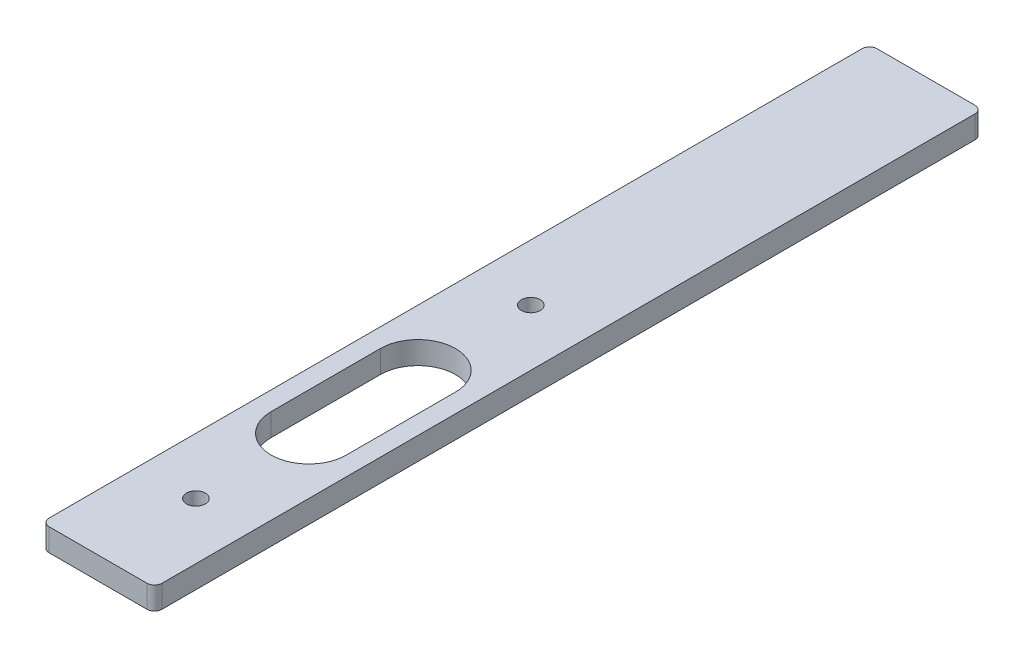
ISO-10303-21;
HEADER;
FILE_DESCRIPTION(('STEP AP214'),'2;1');
FILE_NAME('part.step','',(''),(''),'','','');
FILE_SCHEMA(('AUTOMOTIVE_DESIGN { 1 0 10303 214 1 1 1 1 }'));
ENDSEC;
DATA;
#1=APPLICATION_CONTEXT('core data for automotive mechanical design processes');
#2=APPLICATION_PROTOCOL_DEFINITION('international standard','automotive_design',2000,#1);
#3=PRODUCT_CONTEXT('',#1,'mechanical');
#4=PRODUCT('Part','Part','',(#3));
#5=PRODUCT_RELATED_PRODUCT_CATEGORY('part','',(#4));
#6=PRODUCT_DEFINITION_FORMATION('','',#4);
#7=PRODUCT_DEFINITION_CONTEXT('part definition',#1,'design');
#8=PRODUCT_DEFINITION('design','',#6,#7);
#9=PRODUCT_DEFINITION_SHAPE('','',#8);
#10=(LENGTH_UNIT() NAMED_UNIT(*) SI_UNIT(.MILLI.,.METRE.));
#11=(NAMED_UNIT(*) PLANE_ANGLE_UNIT() SI_UNIT($,.RADIAN.));
#12=(NAMED_UNIT(*) SI_UNIT($,.STERADIAN.) SOLID_ANGLE_UNIT());
#13=UNCERTAINTY_MEASURE_WITH_UNIT(LENGTH_MEASURE(1.E-05),#10,'distance_accuracy_value','');
#14=(GEOMETRIC_REPRESENTATION_CONTEXT(3) GLOBAL_UNCERTAINTY_ASSIGNED_CONTEXT((#13)) GLOBAL_UNIT_ASSIGNED_CONTEXT((#10,
#11,#12)) REPRESENTATION_CONTEXT('',''));
#15=CARTESIAN_POINT('',(0.,0.,0.));
#16=DIRECTION('',(0.,0.,1.));
#17=DIRECTION('',(1.,0.,0.));
#18=AXIS2_PLACEMENT_3D('',#15,#16,#17);
#19=CARTESIAN_POINT('',(0.,3.,0.));
#20=DIRECTION('',(1.,0.,0.));
#21=DIRECTION('',(0.,0.,-1.));
#22=AXIS2_PLACEMENT_3D('',#19,#20,#21);
#23=PLANE('',#22);
#24=DIRECTION('',(0.,0.,1.));
#25=VECTOR('',#24,1.);
#26=CARTESIAN_POINT('',(0.,3.,0.));
#27=LINE('',#26,#25);
#28=CARTESIAN_POINT('',(0.,3.,-109.));
#29=VERTEX_POINT('',#28);
#30=CARTESIAN_POINT('',(0.,3.,-1.));
#31=VERTEX_POINT('',#30);
#32=EDGE_CURVE('E163',#29,#31,#27,.T.);
#33=ORIENTED_EDGE('',*,*,#32,.F.);
#34=DIRECTION('',(0.,-1.,0.));
#35=VECTOR('',#34,1.);
#36=CARTESIAN_POINT('',(0.,3.,-109.));
#37=LINE('',#36,#35);
#38=CARTESIAN_POINT('',(0.,0.,-109.));
#39=VERTEX_POINT('',#38);
#40=EDGE_CURVE('E214',#29,#39,#37,.T.);
#41=ORIENTED_EDGE('',*,*,#40,.T.);
#42=DIRECTION('',(0.,0.,1.));
#43=VECTOR('',#42,1.);
#44=CARTESIAN_POINT('',(0.,0.,0.));
#45=LINE('',#44,#43);
#46=CARTESIAN_POINT('',(0.,0.,-1.));
#47=VERTEX_POINT('',#46);
#48=EDGE_CURVE('E154',#39,#47,#45,.T.);
#49=ORIENTED_EDGE('',*,*,#48,.T.);
#50=DIRECTION('',(0.,-1.,0.));
#51=VECTOR('',#50,1.);
#52=CARTESIAN_POINT('',(0.,3.,-1.));
#53=LINE('',#52,#51);
#54=EDGE_CURVE('E212',#47,#31,#53,.F.);
#55=ORIENTED_EDGE('',*,*,#54,.T.);
#56=EDGE_LOOP('',(#33,#41,#49,#55));
#57=FACE_BOUND('',#56,.T.);
#58=ADVANCED_FACE('F34',(#57),#23,.F.);
#59=CARTESIAN_POINT('',(0.,3.,0.));
#60=DIRECTION('',(0.,0.,-1.));
#61=DIRECTION('',(-1.,0.,0.));
#62=AXIS2_PLACEMENT_3D('',#59,#60,#61);
#63=PLANE('',#62);
#64=DIRECTION('',(1.,0.,0.));
#65=VECTOR('',#64,1.);
#66=CARTESIAN_POINT('',(0.,0.,0.));
#67=LINE('',#66,#65);
#68=CARTESIAN_POINT('',(1.,0.,0.));
#69=VERTEX_POINT('',#68);
#70=CARTESIAN_POINT('',(14.,0.,0.));
#71=VERTEX_POINT('',#70);
#72=EDGE_CURVE('E179',#69,#71,#67,.T.);
#73=ORIENTED_EDGE('',*,*,#72,.T.);
#74=DIRECTION('',(0.,-1.,0.));
#75=VECTOR('',#74,1.);
#76=CARTESIAN_POINT('',(14.,3.,0.));
#77=LINE('',#76,#75);
#78=CARTESIAN_POINT('',(14.,3.,0.));
#79=VERTEX_POINT('',#78);
#80=EDGE_CURVE('E220',#71,#79,#77,.F.);
#81=ORIENTED_EDGE('',*,*,#80,.T.);
#82=DIRECTION('',(1.,0.,0.));
#83=VECTOR('',#82,1.);
#84=CARTESIAN_POINT('',(0.,3.,0.));
#85=LINE('',#84,#83);
#86=CARTESIAN_POINT('',(1.,3.,0.));
#87=VERTEX_POINT('',#86);
#88=EDGE_CURVE('E166',#87,#79,#85,.T.);
#89=ORIENTED_EDGE('',*,*,#88,.F.);
#90=DIRECTION('',(0.,-1.,0.));
#91=VECTOR('',#90,1.);
#92=CARTESIAN_POINT('',(1.,3.,0.));
#93=LINE('',#92,#91);
#94=EDGE_CURVE('E217',#87,#69,#93,.T.);
#95=ORIENTED_EDGE('',*,*,#94,.T.);
#96=EDGE_LOOP('',(#73,#81,#89,#95));
#97=FACE_BOUND('',#96,.T.);
#98=ADVANCED_FACE('F246',(#97),#63,.F.);
#99=CARTESIAN_POINT('',(15.,3.,0.));
#100=DIRECTION('',(-1.,0.,0.));
#101=DIRECTION('',(0.,0.,1.));
#102=AXIS2_PLACEMENT_3D('',#99,#100,#101);
#103=PLANE('',#102);
#104=DIRECTION('',(0.,0.,-1.));
#105=VECTOR('',#104,1.);
#106=CARTESIAN_POINT('',(15.,0.,0.));
#107=LINE('',#106,#105);
#108=CARTESIAN_POINT('',(15.,0.,-1.));
#109=VERTEX_POINT('',#108);
#110=CARTESIAN_POINT('',(15.,0.,-109.));
#111=VERTEX_POINT('',#110);
#112=EDGE_CURVE('E182',#109,#111,#107,.T.);
#113=ORIENTED_EDGE('',*,*,#112,.T.);
#114=DIRECTION('',(0.,-1.,0.));
#115=VECTOR('',#114,1.);
#116=CARTESIAN_POINT('',(15.,3.,-109.));
#117=LINE('',#116,#115);
#118=CARTESIAN_POINT('',(15.,3.,-109.));
#119=VERTEX_POINT('',#118);
#120=EDGE_CURVE('E202',#111,#119,#117,.F.);
#121=ORIENTED_EDGE('',*,*,#120,.T.);
#122=DIRECTION('',(0.,0.,-1.));
#123=VECTOR('',#122,1.);
#124=CARTESIAN_POINT('',(15.,3.,0.));
#125=LINE('',#124,#123);
#126=CARTESIAN_POINT('',(15.,3.,-1.));
#127=VERTEX_POINT('',#126);
#128=EDGE_CURVE('E170',#127,#119,#125,.T.);
#129=ORIENTED_EDGE('',*,*,#128,.F.);
#130=DIRECTION('',(0.,-1.,0.));
#131=VECTOR('',#130,1.);
#132=CARTESIAN_POINT('',(15.,3.,-1.));
#133=LINE('',#132,#131);
#134=EDGE_CURVE('E199',#127,#109,#133,.T.);
#135=ORIENTED_EDGE('',*,*,#134,.T.);
#136=EDGE_LOOP('',(#113,#121,#129,#135));
#137=FACE_BOUND('',#136,.T.);
#138=ADVANCED_FACE('F252',(#137),#103,.F.);
#139=CARTESIAN_POINT('',(0.,3.,-110.));
#140=DIRECTION('',(0.,0.,1.));
#141=DIRECTION('',(1.,0.,0.));
#142=AXIS2_PLACEMENT_3D('',#139,#140,#141);
#143=PLANE('',#142);
#144=DIRECTION('',(-1.,0.,0.));
#145=VECTOR('',#144,1.);
#146=CARTESIAN_POINT('',(0.,3.,-110.));
#147=LINE('',#146,#145);
#148=CARTESIAN_POINT('',(14.,3.,-110.));
#149=VERTEX_POINT('',#148);
#150=CARTESIAN_POINT('',(1.,3.,-110.));
#151=VERTEX_POINT('',#150);
#152=EDGE_CURVE('E173',#149,#151,#147,.T.);
#153=ORIENTED_EDGE('',*,*,#152,.F.);
#154=DIRECTION('',(0.,-1.,0.));
#155=VECTOR('',#154,1.);
#156=CARTESIAN_POINT('',(14.,3.,-110.));
#157=LINE('',#156,#155);
#158=CARTESIAN_POINT('',(14.,0.,-110.));
#159=VERTEX_POINT('',#158);
#160=EDGE_CURVE('E188',#149,#159,#157,.T.);
#161=ORIENTED_EDGE('',*,*,#160,.T.);
#162=DIRECTION('',(-1.,0.,0.));
#163=VECTOR('',#162,1.);
#164=CARTESIAN_POINT('',(0.,0.,-110.));
#165=LINE('',#164,#163);
#166=CARTESIAN_POINT('',(1.,0.,-110.));
#167=VERTEX_POINT('',#166);
#168=EDGE_CURVE('E167',#159,#167,#165,.T.);
#169=ORIENTED_EDGE('',*,*,#168,.T.);
#170=DIRECTION('',(0.,-1.,0.));
#171=VECTOR('',#170,1.);
#172=CARTESIAN_POINT('',(1.,3.,-110.));
#173=LINE('',#172,#171);
#174=EDGE_CURVE('E176',#167,#151,#173,.F.);
#175=ORIENTED_EDGE('',*,*,#174,.T.);
#176=EDGE_LOOP('',(#153,#161,#169,#175));
#177=FACE_BOUND('',#176,.T.);
#178=ADVANCED_FACE('F286',(#177),#143,.F.);
#179=CARTESIAN_POINT('',(0.,3.,0.));
#180=DIRECTION('',(0.,-1.,0.));
#181=DIRECTION('',(0.,0.,-1.));
#182=AXIS2_PLACEMENT_3D('',#179,#180,#181);
#183=PLANE('',#182);
#184=DIRECTION('',(0.,0.,1.));
#185=VECTOR('',#184,1.);
#186=CARTESIAN_POINT('',(2.5,3.,-42.5));
#187=LINE('',#186,#185);
#188=CARTESIAN_POINT('',(2.5,3.,-42.5));
#189=VERTEX_POINT('',#188);
#190=CARTESIAN_POINT('',(2.50000000000001,3.,-28.));
#191=VERTEX_POINT('',#190);
#192=EDGE_CURVE('E134',#189,#191,#187,.T.);
#193=ORIENTED_EDGE('',*,*,#192,.F.);
#194=CARTESIAN_POINT('',(7.5,3.,-42.5));
#195=DIRECTION('',(0.,1.,0.));
#196=DIRECTION('',(0.,0.,1.));
#197=AXIS2_PLACEMENT_3D('',#194,#195,#196);
#198=CIRCLE('',#197,5.);
#199=CARTESIAN_POINT('',(12.5,3.,-42.5));
#200=VERTEX_POINT('',#199);
#201=EDGE_CURVE('E49',#200,#189,#198,.T.);
#202=ORIENTED_EDGE('',*,*,#201,.F.);
#203=DIRECTION('',(0.,0.,-1.));
#204=VECTOR('',#203,1.);
#205=CARTESIAN_POINT('',(12.5,3.,-42.5));
#206=LINE('',#205,#204);
#207=CARTESIAN_POINT('',(12.5,3.,-28.));
#208=VERTEX_POINT('',#207);
#209=EDGE_CURVE('E141',#208,#200,#206,.T.);
#210=ORIENTED_EDGE('',*,*,#209,.F.);
#211=CARTESIAN_POINT('',(7.5,3.,-28.));
#212=DIRECTION('',(0.,1.,0.));
#213=DIRECTION('',(0.,0.,1.));
#214=AXIS2_PLACEMENT_3D('',#211,#212,#213);
#215=CIRCLE('',#214,5.);
#216=EDGE_CURVE('E125',#191,#208,#215,.T.);
#217=ORIENTED_EDGE('',*,*,#216,.F.);
#218=EDGE_LOOP('',(#193,#202,#210,#217));
#219=FACE_BOUND('',#218,.T.);
#220=CARTESIAN_POINT('',(7.5,3.,-13.));
#221=DIRECTION('',(0.,1.,0.));
#222=DIRECTION('',(0.,0.,1.));
#223=AXIS2_PLACEMENT_3D('',#220,#221,#222);
#224=CIRCLE('',#223,1.25);
#225=CARTESIAN_POINT('',(7.5,3.,-11.75));
#226=VERTEX_POINT('',#225);
#227=EDGE_CURVE('E155',#226,#226,#224,.T.);
#228=ORIENTED_EDGE('',*,*,#227,.F.);
#229=EDGE_LOOP('',(#228));
#230=FACE_BOUND('',#229,.T.);
#231=CARTESIAN_POINT('',(7.5,3.,-57.5));
#232=DIRECTION('',(0.,1.,0.));
#233=DIRECTION('',(0.,0.,1.));
#234=AXIS2_PLACEMENT_3D('',#231,#232,#233);
#235=CIRCLE('',#234,1.25);
#236=CARTESIAN_POINT('',(7.5,3.,-56.25));
#237=VERTEX_POINT('',#236);
#238=EDGE_CURVE('E148',#237,#237,#235,.T.);
#239=ORIENTED_EDGE('',*,*,#238,.F.);
#240=EDGE_LOOP('',(#239));
#241=FACE_BOUND('',#240,.T.);
#242=ORIENTED_EDGE('',*,*,#128,.T.);
#243=CARTESIAN_POINT('',(14.,3.,-109.));
#244=DIRECTION('',(0.,-1.,0.));
#245=DIRECTION('',(0.,0.,-1.));
#246=AXIS2_PLACEMENT_3D('',#243,#244,#245);
#247=CIRCLE('',#246,1.);
#248=EDGE_CURVE('E210',#119,#149,#247,.F.);
#249=ORIENTED_EDGE('',*,*,#248,.T.);
#250=ORIENTED_EDGE('',*,*,#152,.T.);
#251=CARTESIAN_POINT('',(1.,3.,-109.));
#252=DIRECTION('',(0.,-1.,0.));
#253=DIRECTION('',(0.,0.,-1.));
#254=AXIS2_PLACEMENT_3D('',#251,#252,#253);
#255=CIRCLE('',#254,1.);
#256=EDGE_CURVE('E208',#151,#29,#255,.F.);
#257=ORIENTED_EDGE('',*,*,#256,.T.);
#258=ORIENTED_EDGE('',*,*,#32,.T.);
#259=CARTESIAN_POINT('',(1.,3.,-1.));
#260=DIRECTION('',(0.,-1.,0.));
#261=DIRECTION('',(0.,0.,-1.));
#262=AXIS2_PLACEMENT_3D('',#259,#260,#261);
#263=CIRCLE('',#262,1.);
#264=EDGE_CURVE('E204',#31,#87,#263,.F.);
#265=ORIENTED_EDGE('',*,*,#264,.T.);
#266=ORIENTED_EDGE('',*,*,#88,.T.);
#267=CARTESIAN_POINT('',(14.,3.,-1.));
#268=DIRECTION('',(0.,-1.,0.));
#269=DIRECTION('',(0.,0.,-1.));
#270=AXIS2_PLACEMENT_3D('',#267,#268,#269);
#271=CIRCLE('',#270,1.);
#272=EDGE_CURVE('E206',#79,#127,#271,.F.);
#273=ORIENTED_EDGE('',*,*,#272,.T.);
#274=EDGE_LOOP('',(#242,#249,#250,#257,#258,#265,#266,#273));
#275=FACE_BOUND('',#274,.T.);
#276=ADVANCED_FACE('F138',(#219,#230,#241,#275),#183,.F.);
#277=CARTESIAN_POINT('',(0.,0.,0.));
#278=DIRECTION('',(0.,-1.,0.));
#279=DIRECTION('',(0.,0.,-1.));
#280=AXIS2_PLACEMENT_3D('',#277,#278,#279);
#281=PLANE('',#280);
#282=CARTESIAN_POINT('',(7.5,0.,-42.5));
#283=DIRECTION('',(0.,-1.,0.));
#284=DIRECTION('',(0.,0.,-1.));
#285=AXIS2_PLACEMENT_3D('',#282,#283,#284);
#286=CIRCLE('',#285,5.);
#287=CARTESIAN_POINT('',(2.5,0.,-42.5));
#288=VERTEX_POINT('',#287);
#289=CARTESIAN_POINT('',(12.5,0.,-42.5));
#290=VERTEX_POINT('',#289);
#291=EDGE_CURVE('E11',#288,#290,#286,.T.);
#292=ORIENTED_EDGE('',*,*,#291,.F.);
#293=DIRECTION('',(0.,0.,-1.));
#294=VECTOR('',#293,1.);
#295=CARTESIAN_POINT('',(2.50000000000001,0.,0.));
#296=LINE('',#295,#294);
#297=CARTESIAN_POINT('',(2.50000000000001,0.,-28.));
#298=VERTEX_POINT('',#297);
#299=EDGE_CURVE('E222',#298,#288,#296,.T.);
#300=ORIENTED_EDGE('',*,*,#299,.F.);
#301=CARTESIAN_POINT('',(7.5,0.,-28.));
#302=DIRECTION('',(0.,-1.,0.));
#303=DIRECTION('',(0.,0.,-1.));
#304=AXIS2_PLACEMENT_3D('',#301,#302,#303);
#305=CIRCLE('',#304,5.);
#306=CARTESIAN_POINT('',(12.5,0.,-28.));
#307=VERTEX_POINT('',#306);
#308=EDGE_CURVE('E128',#307,#298,#305,.T.);
#309=ORIENTED_EDGE('',*,*,#308,.F.);
#310=DIRECTION('',(0.,0.,1.));
#311=VECTOR('',#310,1.);
#312=CARTESIAN_POINT('',(12.5,0.,0.));
#313=LINE('',#312,#311);
#314=EDGE_CURVE('E42',#290,#307,#313,.T.);
#315=ORIENTED_EDGE('',*,*,#314,.F.);
#316=EDGE_LOOP('',(#292,#300,#309,#315));
#317=FACE_BOUND('',#316,.T.);
#318=CARTESIAN_POINT('',(7.5,0.,-13.));
#319=DIRECTION('',(0.,1.,0.));
#320=DIRECTION('',(0.,0.,1.));
#321=AXIS2_PLACEMENT_3D('',#318,#319,#320);
#322=CIRCLE('',#321,1.25);
#323=CARTESIAN_POINT('',(7.5,0.,-11.75));
#324=VERTEX_POINT('',#323);
#325=EDGE_CURVE('E151',#324,#324,#322,.T.);
#326=ORIENTED_EDGE('',*,*,#325,.T.);
#327=EDGE_LOOP('',(#326));
#328=FACE_BOUND('',#327,.T.);
#329=CARTESIAN_POINT('',(7.5,0.,-57.5));
#330=DIRECTION('',(0.,1.,0.));
#331=DIRECTION('',(0.,0.,1.));
#332=AXIS2_PLACEMENT_3D('',#329,#330,#331);
#333=CIRCLE('',#332,1.25);
#334=CARTESIAN_POINT('',(7.5,0.,-56.25));
#335=VERTEX_POINT('',#334);
#336=EDGE_CURVE('E158',#335,#335,#333,.T.);
#337=ORIENTED_EDGE('',*,*,#336,.T.);
#338=EDGE_LOOP('',(#337));
#339=FACE_BOUND('',#338,.T.);
#340=ORIENTED_EDGE('',*,*,#168,.F.);
#341=CARTESIAN_POINT('',(14.,0.,-109.));
#342=DIRECTION('',(0.,-1.,0.));
#343=DIRECTION('',(0.,0.,-1.));
#344=AXIS2_PLACEMENT_3D('',#341,#342,#343);
#345=CIRCLE('',#344,1.);
#346=EDGE_CURVE('E197',#159,#111,#345,.T.);
#347=ORIENTED_EDGE('',*,*,#346,.T.);
#348=ORIENTED_EDGE('',*,*,#112,.F.);
#349=CARTESIAN_POINT('',(14.,0.,-1.));
#350=DIRECTION('',(0.,-1.,0.));
#351=DIRECTION('',(0.,0.,-1.));
#352=AXIS2_PLACEMENT_3D('',#349,#350,#351);
#353=CIRCLE('',#352,1.);
#354=EDGE_CURVE('E193',#109,#71,#353,.T.);
#355=ORIENTED_EDGE('',*,*,#354,.T.);
#356=ORIENTED_EDGE('',*,*,#72,.F.);
#357=CARTESIAN_POINT('',(1.,0.,-1.));
#358=DIRECTION('',(0.,-1.,0.));
#359=DIRECTION('',(0.,0.,-1.));
#360=AXIS2_PLACEMENT_3D('',#357,#358,#359);
#361=CIRCLE('',#360,1.);
#362=EDGE_CURVE('E191',#69,#47,#361,.T.);
#363=ORIENTED_EDGE('',*,*,#362,.T.);
#364=ORIENTED_EDGE('',*,*,#48,.F.);
#365=CARTESIAN_POINT('',(1.,0.,-109.));
#366=DIRECTION('',(0.,-1.,0.));
#367=DIRECTION('',(0.,0.,-1.));
#368=AXIS2_PLACEMENT_3D('',#365,#366,#367);
#369=CIRCLE('',#368,1.);
#370=EDGE_CURVE('E195',#39,#167,#369,.T.);
#371=ORIENTED_EDGE('',*,*,#370,.T.);
#372=EDGE_LOOP('',(#340,#347,#348,#355,#356,#363,#364,#371));
#373=FACE_BOUND('',#372,.T.);
#374=ADVANCED_FACE('F230',(#317,#328,#339,#373),#281,.T.);
#375=CARTESIAN_POINT('',(14.,3.,-109.));
#376=DIRECTION('',(0.,-1.,0.));
#377=DIRECTION('',(0.,0.,-1.));
#378=AXIS2_PLACEMENT_3D('',#375,#376,#377);
#379=CYLINDRICAL_SURFACE('',#378,1.);
#380=ORIENTED_EDGE('',*,*,#248,.F.);
#381=ORIENTED_EDGE('',*,*,#120,.F.);
#382=ORIENTED_EDGE('',*,*,#346,.F.);
#383=ORIENTED_EDGE('',*,*,#160,.F.);
#384=EDGE_LOOP('',(#380,#381,#382,#383));
#385=FACE_BOUND('',#384,.T.);
#386=ADVANCED_FACE('F258',(#385),#379,.T.);
#387=CARTESIAN_POINT('',(1.,3.,-109.));
#388=DIRECTION('',(0.,-1.,0.));
#389=DIRECTION('',(0.,0.,-1.));
#390=AXIS2_PLACEMENT_3D('',#387,#388,#389);
#391=CYLINDRICAL_SURFACE('',#390,1.);
#392=ORIENTED_EDGE('',*,*,#256,.F.);
#393=ORIENTED_EDGE('',*,*,#174,.F.);
#394=ORIENTED_EDGE('',*,*,#370,.F.);
#395=ORIENTED_EDGE('',*,*,#40,.F.);
#396=EDGE_LOOP('',(#392,#393,#394,#395));
#397=FACE_BOUND('',#396,.T.);
#398=ADVANCED_FACE('F261',(#397),#391,.T.);
#399=CARTESIAN_POINT('',(14.,3.,-1.));
#400=DIRECTION('',(0.,-1.,0.));
#401=DIRECTION('',(0.,0.,-1.));
#402=AXIS2_PLACEMENT_3D('',#399,#400,#401);
#403=CYLINDRICAL_SURFACE('',#402,1.);
#404=ORIENTED_EDGE('',*,*,#272,.F.);
#405=ORIENTED_EDGE('',*,*,#80,.F.);
#406=ORIENTED_EDGE('',*,*,#354,.F.);
#407=ORIENTED_EDGE('',*,*,#134,.F.);
#408=EDGE_LOOP('',(#404,#405,#406,#407));
#409=FACE_BOUND('',#408,.T.);
#410=ADVANCED_FACE('F264',(#409),#403,.T.);
#411=CARTESIAN_POINT('',(1.,3.,-1.));
#412=DIRECTION('',(0.,-1.,0.));
#413=DIRECTION('',(0.,0.,-1.));
#414=AXIS2_PLACEMENT_3D('',#411,#412,#413);
#415=CYLINDRICAL_SURFACE('',#414,1.);
#416=ORIENTED_EDGE('',*,*,#264,.F.);
#417=ORIENTED_EDGE('',*,*,#54,.F.);
#418=ORIENTED_EDGE('',*,*,#362,.F.);
#419=ORIENTED_EDGE('',*,*,#94,.F.);
#420=EDGE_LOOP('',(#416,#417,#418,#419));
#421=FACE_BOUND('',#420,.T.);
#422=ADVANCED_FACE('F36',(#421),#415,.T.);
#423=CARTESIAN_POINT('',(7.5,0.,-57.5));
#424=DIRECTION('',(0.,1.,0.));
#425=DIRECTION('',(0.,0.,1.));
#426=AXIS2_PLACEMENT_3D('',#423,#424,#425);
#427=CYLINDRICAL_SURFACE('',#426,1.25);
#428=ORIENTED_EDGE('',*,*,#336,.F.);
#429=EDGE_LOOP('',(#428));
#430=FACE_BOUND('',#429,.T.);
#431=ORIENTED_EDGE('',*,*,#238,.T.);
#432=EDGE_LOOP('',(#431));
#433=FACE_BOUND('',#432,.T.);
#434=ADVANCED_FACE('F241',(#430,#433),#427,.F.);
#435=CARTESIAN_POINT('',(7.5,0.,-13.));
#436=DIRECTION('',(0.,1.,0.));
#437=DIRECTION('',(0.,0.,1.));
#438=AXIS2_PLACEMENT_3D('',#435,#436,#437);
#439=CYLINDRICAL_SURFACE('',#438,1.25);
#440=ORIENTED_EDGE('',*,*,#325,.F.);
#441=EDGE_LOOP('',(#440));
#442=FACE_BOUND('',#441,.T.);
#443=ORIENTED_EDGE('',*,*,#227,.T.);
#444=EDGE_LOOP('',(#443));
#445=FACE_BOUND('',#444,.T.);
#446=ADVANCED_FACE('F234',(#442,#445),#439,.F.);
#447=CARTESIAN_POINT('',(7.5,-7.,-42.5));
#448=DIRECTION('',(0.,1.,0.));
#449=DIRECTION('',(0.,0.,1.));
#450=AXIS2_PLACEMENT_3D('',#447,#448,#449);
#451=CYLINDRICAL_SURFACE('',#450,5.);
#452=ORIENTED_EDGE('',*,*,#291,.T.);
#453=DIRECTION('',(0.,1.,0.));
#454=VECTOR('',#453,1.);
#455=CARTESIAN_POINT('',(12.5,-7.,-42.5));
#456=LINE('',#455,#454);
#457=EDGE_CURVE('E146',#290,#200,#456,.T.);
#458=ORIENTED_EDGE('',*,*,#457,.T.);
#459=ORIENTED_EDGE('',*,*,#201,.T.);
#460=DIRECTION('',(0.,1.,0.));
#461=VECTOR('',#460,1.);
#462=CARTESIAN_POINT('',(2.5,-7.,-42.5));
#463=LINE('',#462,#461);
#464=EDGE_CURVE('E131',#288,#189,#463,.T.);
#465=ORIENTED_EDGE('',*,*,#464,.F.);
#466=EDGE_LOOP('',(#452,#458,#459,#465));
#467=FACE_BOUND('',#466,.T.);
#468=ADVANCED_FACE('F232',(#467),#451,.F.);
#469=CARTESIAN_POINT('',(12.5,-7.,-42.5));
#470=DIRECTION('',(1.,0.,0.));
#471=DIRECTION('',(0.,0.,-1.));
#472=AXIS2_PLACEMENT_3D('',#469,#470,#471);
#473=PLANE('',#472);
#474=ORIENTED_EDGE('',*,*,#314,.T.);
#475=DIRECTION('',(0.,1.,0.));
#476=VECTOR('',#475,1.);
#477=CARTESIAN_POINT('',(12.5,-7.,-28.));
#478=LINE('',#477,#476);
#479=EDGE_CURVE('E130',#307,#208,#478,.T.);
#480=ORIENTED_EDGE('',*,*,#479,.T.);
#481=ORIENTED_EDGE('',*,*,#209,.T.);
#482=ORIENTED_EDGE('',*,*,#457,.F.);
#483=EDGE_LOOP('',(#474,#480,#481,#482));
#484=FACE_BOUND('',#483,.T.);
#485=ADVANCED_FACE('F227',(#484),#473,.F.);
#486=CARTESIAN_POINT('',(7.5,-7.,-28.));
#487=DIRECTION('',(0.,1.,0.));
#488=DIRECTION('',(0.,0.,1.));
#489=AXIS2_PLACEMENT_3D('',#486,#487,#488);
#490=CYLINDRICAL_SURFACE('',#489,5.);
#491=ORIENTED_EDGE('',*,*,#308,.T.);
#492=DIRECTION('',(0.,1.,0.));
#493=VECTOR('',#492,1.);
#494=CARTESIAN_POINT('',(2.50000000000001,-7.,-28.));
#495=LINE('',#494,#493);
#496=EDGE_CURVE('E57',#298,#191,#495,.T.);
#497=ORIENTED_EDGE('',*,*,#496,.T.);
#498=ORIENTED_EDGE('',*,*,#216,.T.);
#499=ORIENTED_EDGE('',*,*,#479,.F.);
#500=EDGE_LOOP('',(#491,#497,#498,#499));
#501=FACE_BOUND('',#500,.T.);
#502=ADVANCED_FACE('F122',(#501),#490,.F.);
#503=CARTESIAN_POINT('',(2.5,-7.,-42.5));
#504=DIRECTION('',(-1.,0.,0.));
#505=DIRECTION('',(0.,0.,1.));
#506=AXIS2_PLACEMENT_3D('',#503,#504,#505);
#507=PLANE('',#506);
#508=ORIENTED_EDGE('',*,*,#299,.T.);
#509=ORIENTED_EDGE('',*,*,#464,.T.);
#510=ORIENTED_EDGE('',*,*,#192,.T.);
#511=ORIENTED_EDGE('',*,*,#496,.F.);
#512=EDGE_LOOP('',(#508,#509,#510,#511));
#513=FACE_BOUND('',#512,.T.);
#514=ADVANCED_FACE('F135',(#513),#507,.F.);
#515=CLOSED_SHELL('',(#58,#98,#138,#178,#276,#374,#386,#398,#410,#422,#434,#446,#468,#485,#502,#514));
#516=MANIFOLD_SOLID_BREP('B2',#515);
#517=ADVANCED_BREP_SHAPE_REPRESENTATION('',(#18,#516),#14);
#518=SHAPE_DEFINITION_REPRESENTATION(#9,#517);
ENDSEC;
END-ISO-10303-21;
